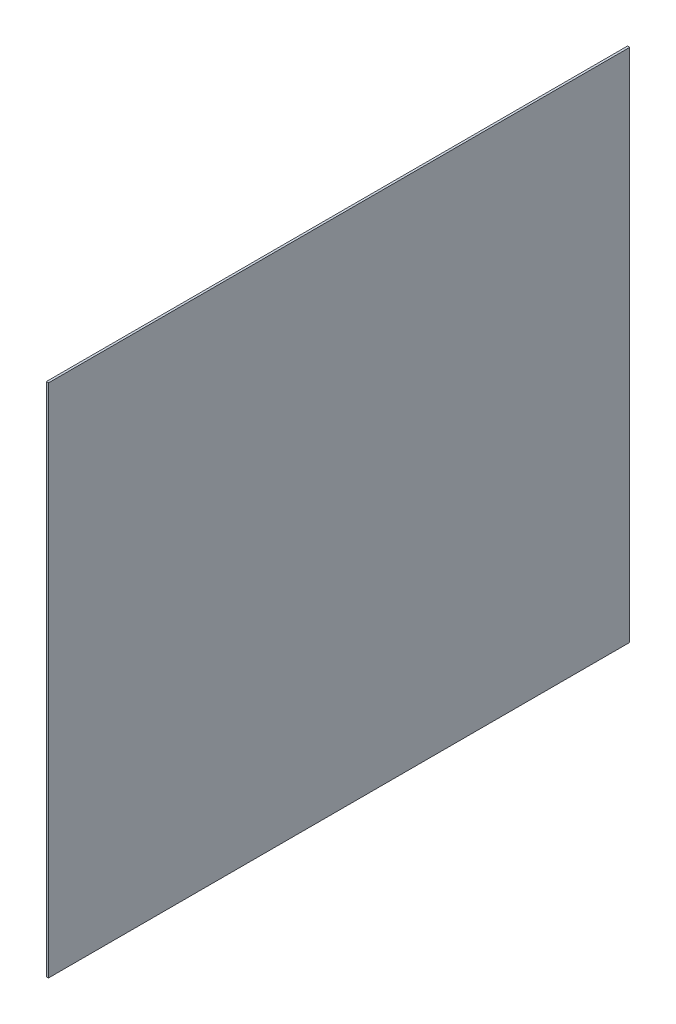
ISO-10303-21;
HEADER;
FILE_DESCRIPTION(('STEP AP214'),'2;1');
FILE_NAME('part.step','',(''),(''),'','','');
FILE_SCHEMA(('AUTOMOTIVE_DESIGN { 1 0 10303 214 1 1 1 1 }'));
ENDSEC;
DATA;
#1=APPLICATION_CONTEXT('core data for automotive mechanical design processes');
#2=APPLICATION_PROTOCOL_DEFINITION('international standard','automotive_design',2000,#1);
#3=PRODUCT_CONTEXT('',#1,'mechanical');
#4=PRODUCT('Part','Part','',(#3));
#5=PRODUCT_RELATED_PRODUCT_CATEGORY('part','',(#4));
#6=PRODUCT_DEFINITION_FORMATION('','',#4);
#7=PRODUCT_DEFINITION_CONTEXT('part definition',#1,'design');
#8=PRODUCT_DEFINITION('design','',#6,#7);
#9=PRODUCT_DEFINITION_SHAPE('','',#8);
#10=(LENGTH_UNIT() NAMED_UNIT(*) SI_UNIT(.MILLI.,.METRE.));
#11=(NAMED_UNIT(*) PLANE_ANGLE_UNIT() SI_UNIT($,.RADIAN.));
#12=(NAMED_UNIT(*) SI_UNIT($,.STERADIAN.) SOLID_ANGLE_UNIT());
#13=UNCERTAINTY_MEASURE_WITH_UNIT(LENGTH_MEASURE(1.E-05),#10,'distance_accuracy_value','');
#14=(GEOMETRIC_REPRESENTATION_CONTEXT(3) GLOBAL_UNCERTAINTY_ASSIGNED_CONTEXT((#13)) GLOBAL_UNIT_ASSIGNED_CONTEXT((#10,
#11,#12)) REPRESENTATION_CONTEXT('',''));
#15=CARTESIAN_POINT('',(0.,0.,0.));
#16=DIRECTION('',(0.,0.,1.));
#17=DIRECTION('',(1.,0.,0.));
#18=AXIS2_PLACEMENT_3D('',#15,#16,#17);
#19=CARTESIAN_POINT('',(1.5875,0.,0.));
#20=DIRECTION('',(0.,0.,-1.));
#21=DIRECTION('',(-1.,0.,0.));
#22=AXIS2_PLACEMENT_3D('',#19,#20,#21);
#23=PLANE('',#22);
#24=DIRECTION('',(0.,-1.,0.));
#25=VECTOR('',#24,1.);
#26=CARTESIAN_POINT('',(0.,0.,0.));
#27=LINE('',#26,#25);
#28=CARTESIAN_POINT('',(0.,365.76,0.));
#29=VERTEX_POINT('',#28);
#30=CARTESIAN_POINT('',(0.,0.,0.));
#31=VERTEX_POINT('',#30);
#32=EDGE_CURVE('E96',#29,#31,#27,.T.);
#33=ORIENTED_EDGE('',*,*,#32,.T.);
#34=DIRECTION('',(-1.,0.,0.));
#35=VECTOR('',#34,1.);
#36=CARTESIAN_POINT('',(1.5875,0.,0.));
#37=LINE('',#36,#35);
#38=CARTESIAN_POINT('',(1.5875,0.,0.));
#39=VERTEX_POINT('',#38);
#40=EDGE_CURVE('E11',#39,#31,#37,.T.);
#41=ORIENTED_EDGE('',*,*,#40,.F.);
#42=DIRECTION('',(0.,-1.,0.));
#43=VECTOR('',#42,1.);
#44=CARTESIAN_POINT('',(1.5875,0.,0.));
#45=LINE('',#44,#43);
#46=CARTESIAN_POINT('',(1.5875,365.76,0.));
#47=VERTEX_POINT('',#46);
#48=EDGE_CURVE('E84',#47,#39,#45,.T.);
#49=ORIENTED_EDGE('',*,*,#48,.F.);
#50=DIRECTION('',(-1.,0.,0.));
#51=VECTOR('',#50,1.);
#52=CARTESIAN_POINT('',(1.5875,365.76,0.));
#53=LINE('',#52,#51);
#54=EDGE_CURVE('E92',#47,#29,#53,.T.);
#55=ORIENTED_EDGE('',*,*,#54,.T.);
#56=EDGE_LOOP('',(#33,#41,#49,#55));
#57=FACE_BOUND('',#56,.T.);
#58=ADVANCED_FACE('F33',(#57),#23,.F.);
#59=CARTESIAN_POINT('',(1.5875,0.,0.));
#60=DIRECTION('',(0.,1.,0.));
#61=DIRECTION('',(0.,0.,1.));
#62=AXIS2_PLACEMENT_3D('',#59,#60,#61);
#63=PLANE('',#62);
#64=DIRECTION('',(0.,0.,-1.));
#65=VECTOR('',#64,1.);
#66=CARTESIAN_POINT('',(0.,0.,0.));
#67=LINE('',#66,#65);
#68=CARTESIAN_POINT('',(0.,0.,-412.496));
#69=VERTEX_POINT('',#68);
#70=EDGE_CURVE('E88',#31,#69,#67,.T.);
#71=ORIENTED_EDGE('',*,*,#70,.T.);
#72=DIRECTION('',(-1.,0.,0.));
#73=VECTOR('',#72,1.);
#74=CARTESIAN_POINT('',(1.5875,0.,-412.496));
#75=LINE('',#74,#73);
#76=CARTESIAN_POINT('',(1.5875,0.,-412.496));
#77=VERTEX_POINT('',#76);
#78=EDGE_CURVE('E41',#77,#69,#75,.T.);
#79=ORIENTED_EDGE('',*,*,#78,.F.);
#80=DIRECTION('',(0.,0.,-1.));
#81=VECTOR('',#80,1.);
#82=CARTESIAN_POINT('',(1.5875,0.,0.));
#83=LINE('',#82,#81);
#84=EDGE_CURVE('E79',#39,#77,#83,.T.);
#85=ORIENTED_EDGE('',*,*,#84,.F.);
#86=ORIENTED_EDGE('',*,*,#40,.T.);
#87=EDGE_LOOP('',(#71,#79,#85,#86));
#88=FACE_BOUND('',#87,.T.);
#89=ADVANCED_FACE('F87',(#88),#63,.F.);
#90=CARTESIAN_POINT('',(1.5875,0.,-412.496));
#91=DIRECTION('',(0.,0.,1.));
#92=DIRECTION('',(1.,0.,0.));
#93=AXIS2_PLACEMENT_3D('',#90,#91,#92);
#94=PLANE('',#93);
#95=DIRECTION('',(0.,1.,0.));
#96=VECTOR('',#95,1.);
#97=CARTESIAN_POINT('',(0.,0.,-412.496));
#98=LINE('',#97,#96);
#99=CARTESIAN_POINT('',(0.,365.76,-412.496));
#100=VERTEX_POINT('',#99);
#101=EDGE_CURVE('E66',#69,#100,#98,.T.);
#102=ORIENTED_EDGE('',*,*,#101,.T.);
#103=DIRECTION('',(-1.,0.,0.));
#104=VECTOR('',#103,1.);
#105=CARTESIAN_POINT('',(1.5875,365.76,-412.496));
#106=LINE('',#105,#104);
#107=CARTESIAN_POINT('',(1.5875,365.76,-412.496));
#108=VERTEX_POINT('',#107);
#109=EDGE_CURVE('E89',#108,#100,#106,.T.);
#110=ORIENTED_EDGE('',*,*,#109,.F.);
#111=DIRECTION('',(0.,1.,0.));
#112=VECTOR('',#111,1.);
#113=CARTESIAN_POINT('',(1.5875,0.,-412.496));
#114=LINE('',#113,#112);
#115=EDGE_CURVE('E82',#77,#108,#114,.T.);
#116=ORIENTED_EDGE('',*,*,#115,.F.);
#117=ORIENTED_EDGE('',*,*,#78,.T.);
#118=EDGE_LOOP('',(#102,#110,#116,#117));
#119=FACE_BOUND('',#118,.T.);
#120=ADVANCED_FACE('F90',(#119),#94,.F.);
#121=CARTESIAN_POINT('',(1.5875,365.76,0.));
#122=DIRECTION('',(0.,-1.,0.));
#123=DIRECTION('',(0.,0.,-1.));
#124=AXIS2_PLACEMENT_3D('',#121,#122,#123);
#125=PLANE('',#124);
#126=DIRECTION('',(0.,0.,1.));
#127=VECTOR('',#126,1.);
#128=CARTESIAN_POINT('',(0.,365.76,0.));
#129=LINE('',#128,#127);
#130=EDGE_CURVE('E72',#100,#29,#129,.T.);
#131=ORIENTED_EDGE('',*,*,#130,.T.);
#132=ORIENTED_EDGE('',*,*,#54,.F.);
#133=DIRECTION('',(0.,0.,1.));
#134=VECTOR('',#133,1.);
#135=CARTESIAN_POINT('',(1.5875,365.76,0.));
#136=LINE('',#135,#134);
#137=EDGE_CURVE('E49',#108,#47,#136,.T.);
#138=ORIENTED_EDGE('',*,*,#137,.F.);
#139=ORIENTED_EDGE('',*,*,#109,.T.);
#140=EDGE_LOOP('',(#131,#132,#138,#139));
#141=FACE_BOUND('',#140,.T.);
#142=ADVANCED_FACE('F103',(#141),#125,.F.);
#143=CARTESIAN_POINT('',(1.5875,0.,0.));
#144=DIRECTION('',(-1.,0.,0.));
#145=DIRECTION('',(0.,0.,1.));
#146=AXIS2_PLACEMENT_3D('',#143,#144,#145);
#147=PLANE('',#146);
#148=ORIENTED_EDGE('',*,*,#48,.T.);
#149=ORIENTED_EDGE('',*,*,#84,.T.);
#150=ORIENTED_EDGE('',*,*,#115,.T.);
#151=ORIENTED_EDGE('',*,*,#137,.T.);
#152=EDGE_LOOP('',(#148,#149,#150,#151));
#153=FACE_BOUND('',#152,.T.);
#154=ADVANCED_FACE('F80',(#153),#147,.F.);
#155=CARTESIAN_POINT('',(0.,0.,0.));
#156=DIRECTION('',(-1.,0.,0.));
#157=DIRECTION('',(0.,0.,1.));
#158=AXIS2_PLACEMENT_3D('',#155,#156,#157);
#159=PLANE('',#158);
#160=ORIENTED_EDGE('',*,*,#32,.F.);
#161=ORIENTED_EDGE('',*,*,#130,.F.);
#162=ORIENTED_EDGE('',*,*,#101,.F.);
#163=ORIENTED_EDGE('',*,*,#70,.F.);
#164=EDGE_LOOP('',(#160,#161,#162,#163));
#165=FACE_BOUND('',#164,.T.);
#166=ADVANCED_FACE('F106',(#165),#159,.T.);
#167=CLOSED_SHELL('',(#58,#89,#120,#142,#154,#166));
#168=MANIFOLD_SOLID_BREP('B2',#167);
#169=ADVANCED_BREP_SHAPE_REPRESENTATION('',(#18,#168),#14);
#170=SHAPE_DEFINITION_REPRESENTATION(#9,#169);
ENDSEC;
END-ISO-10303-21;
